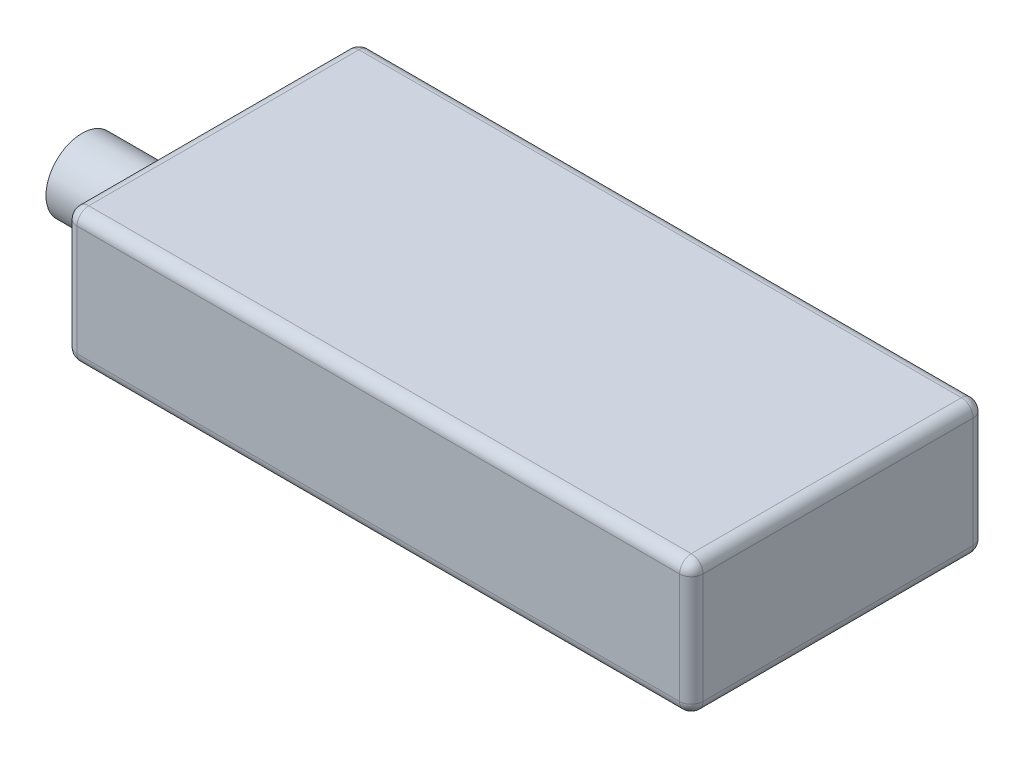
ISO-10303-21;
HEADER;
FILE_DESCRIPTION(('STEP AP214'),'2;1');
FILE_NAME('part.step','',(''),(''),'','','');
FILE_SCHEMA(('AUTOMOTIVE_DESIGN { 1 0 10303 214 1 1 1 1 }'));
ENDSEC;
DATA;
#1=APPLICATION_CONTEXT('core data for automotive mechanical design processes');
#2=APPLICATION_PROTOCOL_DEFINITION('international standard','automotive_design',2000,#1);
#3=PRODUCT_CONTEXT('',#1,'mechanical');
#4=PRODUCT('Part','Part','',(#3));
#5=PRODUCT_RELATED_PRODUCT_CATEGORY('part','',(#4));
#6=PRODUCT_DEFINITION_FORMATION('','',#4);
#7=PRODUCT_DEFINITION_CONTEXT('part definition',#1,'design');
#8=PRODUCT_DEFINITION('design','',#6,#7);
#9=PRODUCT_DEFINITION_SHAPE('','',#8);
#10=(LENGTH_UNIT() NAMED_UNIT(*) SI_UNIT(.MILLI.,.METRE.));
#11=(NAMED_UNIT(*) PLANE_ANGLE_UNIT() SI_UNIT($,.RADIAN.));
#12=(NAMED_UNIT(*) SI_UNIT($,.STERADIAN.) SOLID_ANGLE_UNIT());
#13=UNCERTAINTY_MEASURE_WITH_UNIT(LENGTH_MEASURE(1.E-05),#10,'distance_accuracy_value','');
#14=(GEOMETRIC_REPRESENTATION_CONTEXT(3) GLOBAL_UNCERTAINTY_ASSIGNED_CONTEXT((#13)) GLOBAL_UNIT_ASSIGNED_CONTEXT((#10,
#11,#12)) REPRESENTATION_CONTEXT('',''));
#15=CARTESIAN_POINT('',(0.,0.,0.));
#16=DIRECTION('',(0.,0.,1.));
#17=DIRECTION('',(1.,0.,0.));
#18=AXIS2_PLACEMENT_3D('',#15,#16,#17);
#19=CARTESIAN_POINT('',(26.65,11.4,12.5));
#20=DIRECTION('',(-1.,0.,0.));
#21=DIRECTION('',(0.,0.,1.));
#22=AXIS2_PLACEMENT_3D('',#19,#20,#21);
#23=PLANE('',#22);
#24=DIRECTION('',(0.,-1.,0.));
#25=VECTOR('',#24,1.);
#26=CARTESIAN_POINT('',(26.65,11.4,11.5));
#27=LINE('',#26,#25);
#28=CARTESIAN_POINT('',(26.65,10.4,11.5));
#29=VERTEX_POINT('',#28);
#30=CARTESIAN_POINT('',(26.65,1.,11.5));
#31=VERTEX_POINT('',#30);
#32=EDGE_CURVE('E170',#29,#31,#27,.T.);
#33=ORIENTED_EDGE('',*,*,#32,.T.);
#34=DIRECTION('',(0.,0.,-1.));
#35=VECTOR('',#34,1.);
#36=CARTESIAN_POINT('',(26.65,1.,-12.5));
#37=LINE('',#36,#35);
#38=CARTESIAN_POINT('',(26.65,1.,-11.5));
#39=VERTEX_POINT('',#38);
#40=EDGE_CURVE('E175',#31,#39,#37,.T.);
#41=ORIENTED_EDGE('',*,*,#40,.T.);
#42=DIRECTION('',(0.,-1.,0.));
#43=VECTOR('',#42,1.);
#44=CARTESIAN_POINT('',(26.65,11.4,-11.5));
#45=LINE('',#44,#43);
#46=CARTESIAN_POINT('',(26.65,10.4,-11.5));
#47=VERTEX_POINT('',#46);
#48=EDGE_CURVE('E172',#39,#47,#45,.F.);
#49=ORIENTED_EDGE('',*,*,#48,.T.);
#50=DIRECTION('',(0.,0.,-1.));
#51=VECTOR('',#50,1.);
#52=CARTESIAN_POINT('',(26.65,10.4,12.5));
#53=LINE('',#52,#51);
#54=EDGE_CURVE('E168',#47,#29,#53,.F.);
#55=ORIENTED_EDGE('',*,*,#54,.T.);
#56=EDGE_LOOP('',(#33,#41,#49,#55));
#57=FACE_BOUND('',#56,.T.);
#58=ADVANCED_FACE('F34',(#57),#23,.F.);
#59=CARTESIAN_POINT('',(-26.65,11.4,-12.5));
#60=DIRECTION('',(0.,0.,1.));
#61=DIRECTION('',(1.,0.,0.));
#62=AXIS2_PLACEMENT_3D('',#59,#60,#61);
#63=PLANE('',#62);
#64=DIRECTION('',(0.,-1.,0.));
#65=VECTOR('',#64,1.);
#66=CARTESIAN_POINT('',(25.65,11.4,-12.5));
#67=LINE('',#66,#65);
#68=CARTESIAN_POINT('',(25.65,10.4,-12.5));
#69=VERTEX_POINT('',#68);
#70=CARTESIAN_POINT('',(25.65,1.,-12.5));
#71=VERTEX_POINT('',#70);
#72=EDGE_CURVE('E133',#69,#71,#67,.T.);
#73=ORIENTED_EDGE('',*,*,#72,.T.);
#74=DIRECTION('',(-1.,0.,0.));
#75=VECTOR('',#74,1.);
#76=CARTESIAN_POINT('',(-26.65,1.,-12.5));
#77=LINE('',#76,#75);
#78=CARTESIAN_POINT('',(-25.65,1.,-12.5));
#79=VERTEX_POINT('',#78);
#80=EDGE_CURVE('E129',#71,#79,#77,.T.);
#81=ORIENTED_EDGE('',*,*,#80,.T.);
#82=DIRECTION('',(0.,-1.,0.));
#83=VECTOR('',#82,1.);
#84=CARTESIAN_POINT('',(-25.65,11.4,-12.5));
#85=LINE('',#84,#83);
#86=CARTESIAN_POINT('',(-25.65,10.4,-12.5));
#87=VERTEX_POINT('',#86);
#88=EDGE_CURVE('E121',#79,#87,#85,.F.);
#89=ORIENTED_EDGE('',*,*,#88,.T.);
#90=DIRECTION('',(-1.,0.,0.));
#91=VECTOR('',#90,1.);
#92=CARTESIAN_POINT('',(-26.65,10.4,-12.5));
#93=LINE('',#92,#91);
#94=EDGE_CURVE('E126',#87,#69,#93,.F.);
#95=ORIENTED_EDGE('',*,*,#94,.T.);
#96=EDGE_LOOP('',(#73,#81,#89,#95));
#97=FACE_BOUND('',#96,.T.);
#98=ADVANCED_FACE('F124',(#97),#63,.F.);
#99=CARTESIAN_POINT('',(-26.65,11.4,12.5));
#100=DIRECTION('',(1.,0.,0.));
#101=DIRECTION('',(0.,0.,-1.));
#102=AXIS2_PLACEMENT_3D('',#99,#100,#101);
#103=PLANE('',#102);
#104=CARTESIAN_POINT('',(-26.65,6.865,4.975));
#105=DIRECTION('',(1.,0.,0.));
#106=DIRECTION('',(0.,0.,-1.));
#107=AXIS2_PLACEMENT_3D('',#104,#105,#106);
#108=CIRCLE('',#107,3.065);
#109=CARTESIAN_POINT('',(-26.65,6.865,1.91));
#110=VERTEX_POINT('',#109);
#111=EDGE_CURVE('E11',#110,#110,#108,.F.);
#112=ORIENTED_EDGE('',*,*,#111,.F.);
#113=EDGE_LOOP('',(#112));
#114=FACE_BOUND('',#113,.T.);
#115=DIRECTION('',(0.,-1.,0.));
#116=VECTOR('',#115,1.);
#117=CARTESIAN_POINT('',(-26.65,11.4,-11.5));
#118=LINE('',#117,#116);
#119=CARTESIAN_POINT('',(-26.65,10.4,-11.5));
#120=VERTEX_POINT('',#119);
#121=CARTESIAN_POINT('',(-26.65,1.,-11.5));
#122=VERTEX_POINT('',#121);
#123=EDGE_CURVE('E141',#120,#122,#118,.T.);
#124=ORIENTED_EDGE('',*,*,#123,.T.);
#125=DIRECTION('',(0.,0.,1.));
#126=VECTOR('',#125,1.);
#127=CARTESIAN_POINT('',(-26.65,1.,12.5));
#128=LINE('',#127,#126);
#129=CARTESIAN_POINT('',(-26.65,1.,11.5));
#130=VERTEX_POINT('',#129);
#131=EDGE_CURVE('E182',#122,#130,#128,.T.);
#132=ORIENTED_EDGE('',*,*,#131,.T.);
#133=DIRECTION('',(0.,-1.,0.));
#134=VECTOR('',#133,1.);
#135=CARTESIAN_POINT('',(-26.65,11.4,11.5));
#136=LINE('',#135,#134);
#137=CARTESIAN_POINT('',(-26.65,10.4,11.5));
#138=VERTEX_POINT('',#137);
#139=EDGE_CURVE('E179',#130,#138,#136,.F.);
#140=ORIENTED_EDGE('',*,*,#139,.T.);
#141=DIRECTION('',(0.,0.,1.));
#142=VECTOR('',#141,1.);
#143=CARTESIAN_POINT('',(-26.65,10.4,12.5));
#144=LINE('',#143,#142);
#145=EDGE_CURVE('E177',#138,#120,#144,.F.);
#146=ORIENTED_EDGE('',*,*,#145,.T.);
#147=EDGE_LOOP('',(#124,#132,#140,#146));
#148=FACE_BOUND('',#147,.T.);
#149=ADVANCED_FACE('F330',(#114,#148),#103,.F.);
#150=CARTESIAN_POINT('',(-26.65,11.4,12.5));
#151=DIRECTION('',(0.,0.,-1.));
#152=DIRECTION('',(-1.,0.,0.));
#153=AXIS2_PLACEMENT_3D('',#150,#151,#152);
#154=PLANE('',#153);
#155=DIRECTION('',(0.,-1.,0.));
#156=VECTOR('',#155,1.);
#157=CARTESIAN_POINT('',(-25.65,11.4,12.5));
#158=LINE('',#157,#156);
#159=CARTESIAN_POINT('',(-25.65,10.4,12.5));
#160=VERTEX_POINT('',#159);
#161=CARTESIAN_POINT('',(-25.65,1.,12.5));
#162=VERTEX_POINT('',#161);
#163=EDGE_CURVE('E188',#160,#162,#158,.T.);
#164=ORIENTED_EDGE('',*,*,#163,.T.);
#165=DIRECTION('',(1.,0.,0.));
#166=VECTOR('',#165,1.);
#167=CARTESIAN_POINT('',(26.65,1.,12.5));
#168=LINE('',#167,#166);
#169=CARTESIAN_POINT('',(25.65,1.,12.5));
#170=VERTEX_POINT('',#169);
#171=EDGE_CURVE('E191',#162,#170,#168,.T.);
#172=ORIENTED_EDGE('',*,*,#171,.T.);
#173=DIRECTION('',(0.,-1.,0.));
#174=VECTOR('',#173,1.);
#175=CARTESIAN_POINT('',(25.65,11.4,12.5));
#176=LINE('',#175,#174);
#177=CARTESIAN_POINT('',(25.65,10.4,12.5));
#178=VERTEX_POINT('',#177);
#179=EDGE_CURVE('E186',#170,#178,#176,.F.);
#180=ORIENTED_EDGE('',*,*,#179,.T.);
#181=DIRECTION('',(1.,0.,0.));
#182=VECTOR('',#181,1.);
#183=CARTESIAN_POINT('',(-26.65,10.4,12.5));
#184=LINE('',#183,#182);
#185=EDGE_CURVE('E184',#178,#160,#184,.F.);
#186=ORIENTED_EDGE('',*,*,#185,.T.);
#187=EDGE_LOOP('',(#164,#172,#180,#186));
#188=FACE_BOUND('',#187,.T.);
#189=ADVANCED_FACE('F279',(#188),#154,.F.);
#190=CARTESIAN_POINT('',(0.,11.4,0.));
#191=DIRECTION('',(0.,-1.,0.));
#192=DIRECTION('',(0.,0.,-1.));
#193=AXIS2_PLACEMENT_3D('',#190,#191,#192);
#194=PLANE('',#193);
#195=DIRECTION('',(0.,0.,1.));
#196=VECTOR('',#195,1.);
#197=CARTESIAN_POINT('',(-25.65,11.4,0.));
#198=LINE('',#197,#196);
#199=CARTESIAN_POINT('',(-25.65,11.4,-11.5));
#200=VERTEX_POINT('',#199);
#201=CARTESIAN_POINT('',(-25.65,11.4,11.5));
#202=VERTEX_POINT('',#201);
#203=EDGE_CURVE('E49',#200,#202,#198,.T.);
#204=ORIENTED_EDGE('',*,*,#203,.T.);
#205=DIRECTION('',(1.,0.,0.));
#206=VECTOR('',#205,1.);
#207=CARTESIAN_POINT('',(0.,11.4,11.5));
#208=LINE('',#207,#206);
#209=CARTESIAN_POINT('',(25.65,11.4,11.5));
#210=VERTEX_POINT('',#209);
#211=EDGE_CURVE('E42',#202,#210,#208,.T.);
#212=ORIENTED_EDGE('',*,*,#211,.T.);
#213=DIRECTION('',(0.,0.,-1.));
#214=VECTOR('',#213,1.);
#215=CARTESIAN_POINT('',(25.65,11.4,0.));
#216=LINE('',#215,#214);
#217=CARTESIAN_POINT('',(25.65,11.4,-11.5));
#218=VERTEX_POINT('',#217);
#219=EDGE_CURVE('E202',#210,#218,#216,.T.);
#220=ORIENTED_EDGE('',*,*,#219,.T.);
#221=DIRECTION('',(-1.,0.,0.));
#222=VECTOR('',#221,1.);
#223=CARTESIAN_POINT('',(0.,11.4,-11.5));
#224=LINE('',#223,#222);
#225=EDGE_CURVE('E54',#218,#200,#224,.T.);
#226=ORIENTED_EDGE('',*,*,#225,.T.);
#227=EDGE_LOOP('',(#204,#212,#220,#226));
#228=FACE_BOUND('',#227,.T.);
#229=ADVANCED_FACE('F294',(#228),#194,.F.);
#230=CARTESIAN_POINT('',(0.,0.,0.));
#231=DIRECTION('',(0.,-1.,0.));
#232=DIRECTION('',(0.,0.,-1.));
#233=AXIS2_PLACEMENT_3D('',#230,#231,#232);
#234=PLANE('',#233);
#235=DIRECTION('',(0.,0.,1.));
#236=VECTOR('',#235,1.);
#237=CARTESIAN_POINT('',(-25.65,0.,-12.5));
#238=LINE('',#237,#236);
#239=CARTESIAN_POINT('',(-25.65,0.,11.5));
#240=VERTEX_POINT('',#239);
#241=CARTESIAN_POINT('',(-25.65,0.,-11.5));
#242=VERTEX_POINT('',#241);
#243=EDGE_CURVE('E197',#240,#242,#238,.F.);
#244=ORIENTED_EDGE('',*,*,#243,.T.);
#245=DIRECTION('',(-1.,0.,0.));
#246=VECTOR('',#245,1.);
#247=CARTESIAN_POINT('',(26.65,0.,-11.5));
#248=LINE('',#247,#246);
#249=CARTESIAN_POINT('',(25.65,0.,-11.5));
#250=VERTEX_POINT('',#249);
#251=EDGE_CURVE('E199',#242,#250,#248,.F.);
#252=ORIENTED_EDGE('',*,*,#251,.T.);
#253=DIRECTION('',(0.,0.,-1.));
#254=VECTOR('',#253,1.);
#255=CARTESIAN_POINT('',(25.65,0.,12.5));
#256=LINE('',#255,#254);
#257=CARTESIAN_POINT('',(25.65,0.,11.5));
#258=VERTEX_POINT('',#257);
#259=EDGE_CURVE('E193',#250,#258,#256,.F.);
#260=ORIENTED_EDGE('',*,*,#259,.T.);
#261=DIRECTION('',(1.,0.,0.));
#262=VECTOR('',#261,1.);
#263=CARTESIAN_POINT('',(-26.65,0.,11.5));
#264=LINE('',#263,#262);
#265=EDGE_CURVE('E195',#258,#240,#264,.F.);
#266=ORIENTED_EDGE('',*,*,#265,.T.);
#267=EDGE_LOOP('',(#244,#252,#260,#266));
#268=FACE_BOUND('',#267,.T.);
#269=ADVANCED_FACE('F270',(#268),#234,.T.);
#270=CARTESIAN_POINT('',(-25.65,11.4,11.5));
#271=DIRECTION('',(0.,-1.,0.));
#272=DIRECTION('',(0.,0.,-1.));
#273=AXIS2_PLACEMENT_3D('',#270,#271,#272);
#274=CYLINDRICAL_SURFACE('',#273,1.);
#275=CARTESIAN_POINT('',(-25.65,10.4,11.5));
#276=DIRECTION('',(0.,1.,0.));
#277=DIRECTION('',(0.,0.,1.));
#278=AXIS2_PLACEMENT_3D('',#275,#276,#277);
#279=CIRCLE('',#278,1.);
#280=EDGE_CURVE('E159',#138,#160,#279,.T.);
#281=ORIENTED_EDGE('',*,*,#280,.F.);
#282=ORIENTED_EDGE('',*,*,#139,.F.);
#283=CARTESIAN_POINT('',(-25.65,1.,11.5));
#284=DIRECTION('',(0.,-1.,0.));
#285=DIRECTION('',(0.,0.,-1.));
#286=AXIS2_PLACEMENT_3D('',#283,#284,#285);
#287=CIRCLE('',#286,1.);
#288=EDGE_CURVE('E162',#162,#130,#287,.T.);
#289=ORIENTED_EDGE('',*,*,#288,.F.);
#290=ORIENTED_EDGE('',*,*,#163,.F.);
#291=EDGE_LOOP('',(#281,#282,#289,#290));
#292=FACE_BOUND('',#291,.T.);
#293=ADVANCED_FACE('F36',(#292),#274,.T.);
#294=CARTESIAN_POINT('',(-25.65,10.4,11.5));
#295=DIRECTION('',(0.,0.,1.));
#296=DIRECTION('',(1.,0.,0.));
#297=AXIS2_PLACEMENT_3D('',#294,#295,#296);
#298=SPHERICAL_SURFACE('',#297,1.);
#299=CARTESIAN_POINT('',(-25.65,10.4,11.5));
#300=DIRECTION('',(0.,0.,1.));
#301=DIRECTION('',(1.,0.,0.));
#302=AXIS2_PLACEMENT_3D('',#299,#300,#301);
#303=CIRCLE('',#302,1.);
#304=EDGE_CURVE('E249',#138,#202,#303,.F.);
#305=ORIENTED_EDGE('',*,*,#304,.F.);
#306=ORIENTED_EDGE('',*,*,#280,.T.);
#307=CARTESIAN_POINT('',(-25.65,10.4,11.5));
#308=DIRECTION('',(-1.,0.,0.));
#309=DIRECTION('',(0.,0.,1.));
#310=AXIS2_PLACEMENT_3D('',#307,#308,#309);
#311=CIRCLE('',#310,1.);
#312=EDGE_CURVE('E251',#202,#160,#311,.F.);
#313=ORIENTED_EDGE('',*,*,#312,.F.);
#314=EDGE_LOOP('',(#305,#306,#313));
#315=FACE_BOUND('',#314,.T.);
#316=ADVANCED_FACE('F484',(#315),#298,.T.);
#317=CARTESIAN_POINT('',(-25.65,1.,11.5));
#318=DIRECTION('',(0.,0.,1.));
#319=DIRECTION('',(1.,0.,0.));
#320=AXIS2_PLACEMENT_3D('',#317,#318,#319);
#321=SPHERICAL_SURFACE('',#320,1.);
#322=CARTESIAN_POINT('',(-25.65,1.,11.5));
#323=DIRECTION('',(-1.,0.,0.));
#324=DIRECTION('',(0.,0.,1.));
#325=AXIS2_PLACEMENT_3D('',#322,#323,#324);
#326=CIRCLE('',#325,1.);
#327=EDGE_CURVE('E243',#162,#240,#326,.F.);
#328=ORIENTED_EDGE('',*,*,#327,.F.);
#329=ORIENTED_EDGE('',*,*,#288,.T.);
#330=CARTESIAN_POINT('',(-25.65,1.,11.5));
#331=DIRECTION('',(0.,0.,1.));
#332=DIRECTION('',(1.,0.,0.));
#333=AXIS2_PLACEMENT_3D('',#330,#331,#332);
#334=CIRCLE('',#333,1.);
#335=EDGE_CURVE('E246',#240,#130,#334,.F.);
#336=ORIENTED_EDGE('',*,*,#335,.F.);
#337=EDGE_LOOP('',(#328,#329,#336));
#338=FACE_BOUND('',#337,.T.);
#339=ADVANCED_FACE('F259',(#338),#321,.T.);
#340=CARTESIAN_POINT('',(0.,10.4,11.5));
#341=DIRECTION('',(1.,0.,0.));
#342=DIRECTION('',(0.,0.,-1.));
#343=AXIS2_PLACEMENT_3D('',#340,#341,#342);
#344=CYLINDRICAL_SURFACE('',#343,1.);
#345=ORIENTED_EDGE('',*,*,#312,.T.);
#346=ORIENTED_EDGE('',*,*,#185,.F.);
#347=CARTESIAN_POINT('',(25.65,10.4,11.5));
#348=DIRECTION('',(1.,0.,0.));
#349=DIRECTION('',(0.,0.,-1.));
#350=AXIS2_PLACEMENT_3D('',#347,#348,#349);
#351=CIRCLE('',#350,1.);
#352=EDGE_CURVE('E237',#210,#178,#351,.T.);
#353=ORIENTED_EDGE('',*,*,#352,.F.);
#354=ORIENTED_EDGE('',*,*,#211,.F.);
#355=EDGE_LOOP('',(#345,#346,#353,#354));
#356=FACE_BOUND('',#355,.T.);
#357=ADVANCED_FACE('F293',(#356),#344,.T.);
#358=CARTESIAN_POINT('',(-25.65,10.4,0.));
#359=DIRECTION('',(0.,0.,1.));
#360=DIRECTION('',(1.,0.,0.));
#361=AXIS2_PLACEMENT_3D('',#358,#359,#360);
#362=CYLINDRICAL_SURFACE('',#361,1.);
#363=ORIENTED_EDGE('',*,*,#304,.T.);
#364=ORIENTED_EDGE('',*,*,#203,.F.);
#365=CARTESIAN_POINT('',(-25.65,10.4,-11.5));
#366=DIRECTION('',(0.,0.,-1.));
#367=DIRECTION('',(0.,1.,0.));
#368=AXIS2_PLACEMENT_3D('',#365,#366,#367);
#369=CIRCLE('',#368,1.);
#370=EDGE_CURVE('E145',#120,#200,#369,.T.);
#371=ORIENTED_EDGE('',*,*,#370,.F.);
#372=ORIENTED_EDGE('',*,*,#145,.F.);
#373=EDGE_LOOP('',(#363,#364,#371,#372));
#374=FACE_BOUND('',#373,.T.);
#375=ADVANCED_FACE('F461',(#374),#362,.T.);
#376=CARTESIAN_POINT('',(-25.65,11.4,-11.5));
#377=DIRECTION('',(0.,-1.,0.));
#378=DIRECTION('',(0.,0.,-1.));
#379=AXIS2_PLACEMENT_3D('',#376,#377,#378);
#380=CYLINDRICAL_SURFACE('',#379,1.);
#381=CARTESIAN_POINT('',(-25.65,1.,-11.5));
#382=DIRECTION('',(0.,-1.,0.));
#383=DIRECTION('',(0.,0.,-1.));
#384=AXIS2_PLACEMENT_3D('',#381,#382,#383);
#385=CIRCLE('',#384,1.);
#386=EDGE_CURVE('E146',#122,#79,#385,.T.);
#387=ORIENTED_EDGE('',*,*,#386,.F.);
#388=ORIENTED_EDGE('',*,*,#123,.F.);
#389=CARTESIAN_POINT('',(-25.65,10.4,-11.5));
#390=DIRECTION('',(0.,1.,0.));
#391=DIRECTION('',(0.,0.,1.));
#392=AXIS2_PLACEMENT_3D('',#389,#390,#391);
#393=CIRCLE('',#392,1.);
#394=EDGE_CURVE('E137',#87,#120,#393,.T.);
#395=ORIENTED_EDGE('',*,*,#394,.F.);
#396=ORIENTED_EDGE('',*,*,#88,.F.);
#397=EDGE_LOOP('',(#387,#388,#395,#396));
#398=FACE_BOUND('',#397,.T.);
#399=ADVANCED_FACE('F139',(#398),#380,.T.);
#400=CARTESIAN_POINT('',(-25.65,1.,12.5));
#401=DIRECTION('',(0.,0.,-1.));
#402=DIRECTION('',(-1.,0.,0.));
#403=AXIS2_PLACEMENT_3D('',#400,#401,#402);
#404=CYLINDRICAL_SURFACE('',#403,1.);
#405=ORIENTED_EDGE('',*,*,#335,.T.);
#406=ORIENTED_EDGE('',*,*,#131,.F.);
#407=CARTESIAN_POINT('',(-25.65,1.,-11.5));
#408=DIRECTION('',(0.,0.,-1.));
#409=DIRECTION('',(-1.,0.,0.));
#410=AXIS2_PLACEMENT_3D('',#407,#408,#409);
#411=CIRCLE('',#410,1.);
#412=EDGE_CURVE('E233',#242,#122,#411,.T.);
#413=ORIENTED_EDGE('',*,*,#412,.F.);
#414=ORIENTED_EDGE('',*,*,#243,.F.);
#415=EDGE_LOOP('',(#405,#406,#413,#414));
#416=FACE_BOUND('',#415,.T.);
#417=ADVANCED_FACE('F266',(#416),#404,.T.);
#418=CARTESIAN_POINT('',(-26.65,1.,11.5));
#419=DIRECTION('',(-1.,0.,0.));
#420=DIRECTION('',(0.,0.,1.));
#421=AXIS2_PLACEMENT_3D('',#418,#419,#420);
#422=CYLINDRICAL_SURFACE('',#421,1.);
#423=ORIENTED_EDGE('',*,*,#327,.T.);
#424=ORIENTED_EDGE('',*,*,#265,.F.);
#425=CARTESIAN_POINT('',(25.65,1.,11.5));
#426=DIRECTION('',(1.,0.,0.));
#427=DIRECTION('',(0.,0.,-1.));
#428=AXIS2_PLACEMENT_3D('',#425,#426,#427);
#429=CIRCLE('',#428,1.);
#430=EDGE_CURVE('E230',#170,#258,#429,.T.);
#431=ORIENTED_EDGE('',*,*,#430,.F.);
#432=ORIENTED_EDGE('',*,*,#171,.F.);
#433=EDGE_LOOP('',(#423,#424,#431,#432));
#434=FACE_BOUND('',#433,.T.);
#435=ADVANCED_FACE('F276',(#434),#422,.T.);
#436=CARTESIAN_POINT('',(25.65,11.4,11.5));
#437=DIRECTION('',(0.,-1.,0.));
#438=DIRECTION('',(0.,0.,-1.));
#439=AXIS2_PLACEMENT_3D('',#436,#437,#438);
#440=CYLINDRICAL_SURFACE('',#439,1.);
#441=CARTESIAN_POINT('',(25.65,10.4,11.5));
#442=DIRECTION('',(0.,1.,0.));
#443=DIRECTION('',(0.,0.,1.));
#444=AXIS2_PLACEMENT_3D('',#441,#442,#443);
#445=CIRCLE('',#444,1.);
#446=EDGE_CURVE('E240',#178,#29,#445,.T.);
#447=ORIENTED_EDGE('',*,*,#446,.F.);
#448=ORIENTED_EDGE('',*,*,#179,.F.);
#449=CARTESIAN_POINT('',(25.65,1.,11.5));
#450=DIRECTION('',(0.,-1.,0.));
#451=DIRECTION('',(0.,0.,-1.));
#452=AXIS2_PLACEMENT_3D('',#449,#450,#451);
#453=CIRCLE('',#452,1.);
#454=EDGE_CURVE('E227',#31,#170,#453,.T.);
#455=ORIENTED_EDGE('',*,*,#454,.F.);
#456=ORIENTED_EDGE('',*,*,#32,.F.);
#457=EDGE_LOOP('',(#447,#448,#455,#456));
#458=FACE_BOUND('',#457,.T.);
#459=ADVANCED_FACE('F284',(#458),#440,.T.);
#460=CARTESIAN_POINT('',(25.65,10.4,11.5));
#461=DIRECTION('',(0.,0.,1.));
#462=DIRECTION('',(1.,0.,0.));
#463=AXIS2_PLACEMENT_3D('',#460,#461,#462);
#464=SPHERICAL_SURFACE('',#463,1.);
#465=ORIENTED_EDGE('',*,*,#352,.T.);
#466=ORIENTED_EDGE('',*,*,#446,.T.);
#467=CARTESIAN_POINT('',(25.65,10.4,11.5));
#468=DIRECTION('',(0.,0.,1.));
#469=DIRECTION('',(1.,0.,0.));
#470=AXIS2_PLACEMENT_3D('',#467,#468,#469);
#471=CIRCLE('',#470,1.);
#472=EDGE_CURVE('E152',#210,#29,#471,.F.);
#473=ORIENTED_EDGE('',*,*,#472,.F.);
#474=EDGE_LOOP('',(#465,#466,#473));
#475=FACE_BOUND('',#474,.T.);
#476=ADVANCED_FACE('F290',(#475),#464,.T.);
#477=CARTESIAN_POINT('',(-25.65,10.4,-11.5));
#478=DIRECTION('',(0.,0.,1.));
#479=DIRECTION('',(1.,0.,0.));
#480=AXIS2_PLACEMENT_3D('',#477,#478,#479);
#481=SPHERICAL_SURFACE('',#480,1.);
#482=ORIENTED_EDGE('',*,*,#394,.T.);
#483=ORIENTED_EDGE('',*,*,#370,.T.);
#484=CARTESIAN_POINT('',(-25.65,10.4,-11.5));
#485=DIRECTION('',(-1.,0.,0.));
#486=DIRECTION('',(0.,0.,1.));
#487=AXIS2_PLACEMENT_3D('',#484,#485,#486);
#488=CIRCLE('',#487,1.);
#489=EDGE_CURVE('E149',#87,#200,#488,.F.);
#490=ORIENTED_EDGE('',*,*,#489,.F.);
#491=EDGE_LOOP('',(#482,#483,#490));
#492=FACE_BOUND('',#491,.T.);
#493=ADVANCED_FACE('F150',(#492),#481,.T.);
#494=CARTESIAN_POINT('',(-25.65,1.,-11.5));
#495=DIRECTION('',(0.,0.,1.));
#496=DIRECTION('',(1.,0.,0.));
#497=AXIS2_PLACEMENT_3D('',#494,#495,#496);
#498=SPHERICAL_SURFACE('',#497,1.);
#499=ORIENTED_EDGE('',*,*,#412,.T.);
#500=ORIENTED_EDGE('',*,*,#386,.T.);
#501=CARTESIAN_POINT('',(-25.65,1.,-11.5));
#502=DIRECTION('',(-1.,0.,0.));
#503=DIRECTION('',(0.,0.,1.));
#504=AXIS2_PLACEMENT_3D('',#501,#502,#503);
#505=CIRCLE('',#504,1.);
#506=EDGE_CURVE('E153',#242,#79,#505,.F.);
#507=ORIENTED_EDGE('',*,*,#506,.F.);
#508=EDGE_LOOP('',(#499,#500,#507));
#509=FACE_BOUND('',#508,.T.);
#510=ADVANCED_FACE('F313',(#509),#498,.T.);
#511=CARTESIAN_POINT('',(25.65,1.,11.5));
#512=DIRECTION('',(0.,0.,1.));
#513=DIRECTION('',(1.,0.,0.));
#514=AXIS2_PLACEMENT_3D('',#511,#512,#513);
#515=SPHERICAL_SURFACE('',#514,1.);
#516=ORIENTED_EDGE('',*,*,#454,.T.);
#517=ORIENTED_EDGE('',*,*,#430,.T.);
#518=CARTESIAN_POINT('',(25.65,1.,11.5));
#519=DIRECTION('',(0.,0.,1.));
#520=DIRECTION('',(1.,0.,0.));
#521=AXIS2_PLACEMENT_3D('',#518,#519,#520);
#522=CIRCLE('',#521,1.);
#523=EDGE_CURVE('E220',#31,#258,#522,.F.);
#524=ORIENTED_EDGE('',*,*,#523,.F.);
#525=EDGE_LOOP('',(#516,#517,#524));
#526=FACE_BOUND('',#525,.T.);
#527=ADVANCED_FACE('F315',(#526),#515,.T.);
#528=CARTESIAN_POINT('',(25.65,10.4,0.));
#529=DIRECTION('',(0.,0.,-1.));
#530=DIRECTION('',(-1.,0.,0.));
#531=AXIS2_PLACEMENT_3D('',#528,#529,#530);
#532=CYLINDRICAL_SURFACE('',#531,1.);
#533=ORIENTED_EDGE('',*,*,#472,.T.);
#534=ORIENTED_EDGE('',*,*,#54,.F.);
#535=CARTESIAN_POINT('',(25.65,10.4,-11.5));
#536=DIRECTION('',(0.,0.,-1.));
#537=DIRECTION('',(-1.,0.,0.));
#538=AXIS2_PLACEMENT_3D('',#535,#536,#537);
#539=CIRCLE('',#538,1.);
#540=EDGE_CURVE('E217',#218,#47,#539,.T.);
#541=ORIENTED_EDGE('',*,*,#540,.F.);
#542=ORIENTED_EDGE('',*,*,#219,.F.);
#543=EDGE_LOOP('',(#533,#534,#541,#542));
#544=FACE_BOUND('',#543,.T.);
#545=ADVANCED_FACE('F298',(#544),#532,.T.);
#546=CARTESIAN_POINT('',(0.,10.4,-11.5));
#547=DIRECTION('',(-1.,0.,0.));
#548=DIRECTION('',(0.,0.,1.));
#549=AXIS2_PLACEMENT_3D('',#546,#547,#548);
#550=CYLINDRICAL_SURFACE('',#549,1.);
#551=ORIENTED_EDGE('',*,*,#489,.T.);
#552=ORIENTED_EDGE('',*,*,#225,.F.);
#553=CARTESIAN_POINT('',(25.65,10.4,-11.5));
#554=DIRECTION('',(1.,0.,0.));
#555=DIRECTION('',(0.,0.,-1.));
#556=AXIS2_PLACEMENT_3D('',#553,#554,#555);
#557=CIRCLE('',#556,1.);
#558=EDGE_CURVE('E157',#69,#218,#557,.T.);
#559=ORIENTED_EDGE('',*,*,#558,.F.);
#560=ORIENTED_EDGE('',*,*,#94,.F.);
#561=EDGE_LOOP('',(#551,#552,#559,#560));
#562=FACE_BOUND('',#561,.T.);
#563=ADVANCED_FACE('F155',(#562),#550,.T.);
#564=CARTESIAN_POINT('',(-26.65,1.,-11.5));
#565=DIRECTION('',(1.,0.,0.));
#566=DIRECTION('',(0.,0.,-1.));
#567=AXIS2_PLACEMENT_3D('',#564,#565,#566);
#568=CYLINDRICAL_SURFACE('',#567,1.);
#569=ORIENTED_EDGE('',*,*,#506,.T.);
#570=ORIENTED_EDGE('',*,*,#80,.F.);
#571=CARTESIAN_POINT('',(25.65,1.,-11.5));
#572=DIRECTION('',(1.,0.,0.));
#573=DIRECTION('',(0.,0.,-1.));
#574=AXIS2_PLACEMENT_3D('',#571,#572,#573);
#575=CIRCLE('',#574,1.);
#576=EDGE_CURVE('E213',#250,#71,#575,.T.);
#577=ORIENTED_EDGE('',*,*,#576,.F.);
#578=ORIENTED_EDGE('',*,*,#251,.F.);
#579=EDGE_LOOP('',(#569,#570,#577,#578));
#580=FACE_BOUND('',#579,.T.);
#581=ADVANCED_FACE('F311',(#580),#568,.T.);
#582=CARTESIAN_POINT('',(25.65,1.,12.5));
#583=DIRECTION('',(0.,0.,1.));
#584=DIRECTION('',(1.,0.,0.));
#585=AXIS2_PLACEMENT_3D('',#582,#583,#584);
#586=CYLINDRICAL_SURFACE('',#585,1.);
#587=ORIENTED_EDGE('',*,*,#523,.T.);
#588=ORIENTED_EDGE('',*,*,#259,.F.);
#589=CARTESIAN_POINT('',(25.65,1.,-11.5));
#590=DIRECTION('',(0.,0.,-1.));
#591=DIRECTION('',(-1.,0.,0.));
#592=AXIS2_PLACEMENT_3D('',#589,#590,#591);
#593=CIRCLE('',#592,1.);
#594=EDGE_CURVE('E211',#39,#250,#593,.T.);
#595=ORIENTED_EDGE('',*,*,#594,.F.);
#596=ORIENTED_EDGE('',*,*,#40,.F.);
#597=EDGE_LOOP('',(#587,#588,#595,#596));
#598=FACE_BOUND('',#597,.T.);
#599=ADVANCED_FACE('F341',(#598),#586,.T.);
#600=CARTESIAN_POINT('',(25.65,10.4,-11.5));
#601=DIRECTION('',(0.,0.,1.));
#602=DIRECTION('',(1.,0.,0.));
#603=AXIS2_PLACEMENT_3D('',#600,#601,#602);
#604=SPHERICAL_SURFACE('',#603,1.);
#605=ORIENTED_EDGE('',*,*,#558,.T.);
#606=ORIENTED_EDGE('',*,*,#540,.T.);
#607=CARTESIAN_POINT('',(25.65,10.4,-11.5));
#608=DIRECTION('',(0.,1.,0.));
#609=DIRECTION('',(0.,0.,1.));
#610=AXIS2_PLACEMENT_3D('',#607,#608,#609);
#611=CIRCLE('',#610,1.);
#612=EDGE_CURVE('E209',#69,#47,#611,.F.);
#613=ORIENTED_EDGE('',*,*,#612,.F.);
#614=EDGE_LOOP('',(#605,#606,#613));
#615=FACE_BOUND('',#614,.T.);
#616=ADVANCED_FACE('F300',(#615),#604,.T.);
#617=CARTESIAN_POINT('',(25.65,1.,-11.5));
#618=DIRECTION('',(0.,0.,1.));
#619=DIRECTION('',(1.,0.,0.));
#620=AXIS2_PLACEMENT_3D('',#617,#618,#619);
#621=SPHERICAL_SURFACE('',#620,1.);
#622=ORIENTED_EDGE('',*,*,#594,.T.);
#623=ORIENTED_EDGE('',*,*,#576,.T.);
#624=CARTESIAN_POINT('',(25.65,1.,-11.5));
#625=DIRECTION('',(0.,-1.,0.));
#626=DIRECTION('',(0.,0.,-1.));
#627=AXIS2_PLACEMENT_3D('',#624,#625,#626);
#628=CIRCLE('',#627,1.);
#629=EDGE_CURVE('E207',#39,#71,#628,.F.);
#630=ORIENTED_EDGE('',*,*,#629,.F.);
#631=EDGE_LOOP('',(#622,#623,#630));
#632=FACE_BOUND('',#631,.T.);
#633=ADVANCED_FACE('F308',(#632),#621,.T.);
#634=CARTESIAN_POINT('',(25.65,11.4,-11.5));
#635=DIRECTION('',(0.,-1.,0.));
#636=DIRECTION('',(0.,0.,-1.));
#637=AXIS2_PLACEMENT_3D('',#634,#635,#636);
#638=CYLINDRICAL_SURFACE('',#637,1.);
#639=ORIENTED_EDGE('',*,*,#612,.T.);
#640=ORIENTED_EDGE('',*,*,#48,.F.);
#641=ORIENTED_EDGE('',*,*,#629,.T.);
#642=ORIENTED_EDGE('',*,*,#72,.F.);
#643=EDGE_LOOP('',(#639,#640,#641,#642));
#644=FACE_BOUND('',#643,.T.);
#645=ADVANCED_FACE('F304',(#644),#638,.T.);
#646=CARTESIAN_POINT('',(-32.75,6.865,4.975));
#647=DIRECTION('',(1.,0.,0.));
#648=DIRECTION('',(0.,0.,-1.));
#649=AXIS2_PLACEMENT_3D('',#646,#647,#648);
#650=CYLINDRICAL_SURFACE('',#649,3.065);
#651=CARTESIAN_POINT('',(-32.75,6.865,4.975));
#652=DIRECTION('',(-1.,0.,0.));
#653=DIRECTION('',(0.,0.,1.));
#654=AXIS2_PLACEMENT_3D('',#651,#652,#653);
#655=CIRCLE('',#654,3.065);
#656=CARTESIAN_POINT('',(-32.75,6.865,8.04));
#657=VERTEX_POINT('',#656);
#658=EDGE_CURVE('E164',#657,#657,#655,.T.);
#659=ORIENTED_EDGE('',*,*,#658,.F.);
#660=EDGE_LOOP('',(#659));
#661=FACE_BOUND('',#660,.T.);
#662=ORIENTED_EDGE('',*,*,#111,.T.);
#663=EDGE_LOOP('',(#662));
#664=FACE_BOUND('',#663,.T.);
#665=ADVANCED_FACE('F336',(#661,#664),#650,.T.);
#666=CARTESIAN_POINT('',(-32.75,6.865,4.975));
#667=DIRECTION('',(-1.,0.,0.));
#668=DIRECTION('',(0.,0.,1.));
#669=AXIS2_PLACEMENT_3D('',#666,#667,#668);
#670=PLANE('',#669);
#671=ORIENTED_EDGE('',*,*,#658,.T.);
#672=EDGE_LOOP('',(#671));
#673=FACE_BOUND('',#672,.T.);
#674=ADVANCED_FACE('F385',(#673),#670,.T.);
#675=CLOSED_SHELL('',(#58,#98,#149,#189,#229,#269,#293,#316,#339,#357,#375,#399,#417,#435,#459,
#476,#493,#510,#527,#545,#563,#581,#599,#616,#633,#645,#665,#674));
#676=MANIFOLD_SOLID_BREP('B2',#675);
#677=ADVANCED_BREP_SHAPE_REPRESENTATION('',(#18,#676),#14);
#678=SHAPE_DEFINITION_REPRESENTATION(#9,#677);
ENDSEC;
END-ISO-10303-21;
